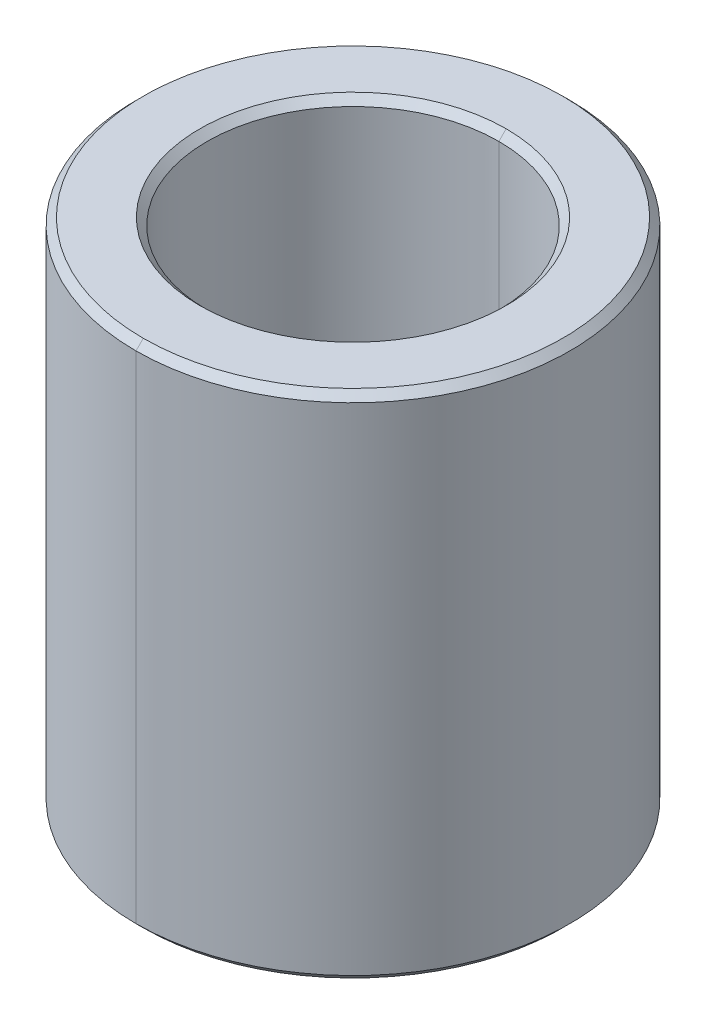
ISO-10303-21;
HEADER;
FILE_DESCRIPTION(('STEP AP214'),'2;1');
FILE_NAME('part.step','',(''),(''),'','','');
FILE_SCHEMA(('AUTOMOTIVE_DESIGN { 1 0 10303 214 1 1 1 1 }'));
ENDSEC;
DATA;
#1=APPLICATION_CONTEXT('core data for automotive mechanical design processes');
#2=APPLICATION_PROTOCOL_DEFINITION('international standard','automotive_design',2000,#1);
#3=PRODUCT_CONTEXT('',#1,'mechanical');
#4=PRODUCT('Part','Part','',(#3));
#5=PRODUCT_RELATED_PRODUCT_CATEGORY('part','',(#4));
#6=PRODUCT_DEFINITION_FORMATION('','',#4);
#7=PRODUCT_DEFINITION_CONTEXT('part definition',#1,'design');
#8=PRODUCT_DEFINITION('design','',#6,#7);
#9=PRODUCT_DEFINITION_SHAPE('','',#8);
#10=(LENGTH_UNIT() NAMED_UNIT(*) SI_UNIT(.MILLI.,.METRE.));
#11=(NAMED_UNIT(*) PLANE_ANGLE_UNIT() SI_UNIT($,.RADIAN.));
#12=(NAMED_UNIT(*) SI_UNIT($,.STERADIAN.) SOLID_ANGLE_UNIT());
#13=UNCERTAINTY_MEASURE_WITH_UNIT(LENGTH_MEASURE(1.E-05),#10,'distance_accuracy_value','');
#14=(GEOMETRIC_REPRESENTATION_CONTEXT(3) GLOBAL_UNCERTAINTY_ASSIGNED_CONTEXT((#13)) GLOBAL_UNIT_ASSIGNED_CONTEXT((#10,
#11,#12)) REPRESENTATION_CONTEXT('',''));
#15=CARTESIAN_POINT('',(0.,0.,0.));
#16=DIRECTION('',(0.,0.,1.));
#17=DIRECTION('',(1.,0.,0.));
#18=AXIS2_PLACEMENT_3D('',#15,#16,#17);
#19=CARTESIAN_POINT('',(0.,3.4,0.));
#20=DIRECTION('',(0.,1.,0.));
#21=DIRECTION('',(0.,0.,1.));
#22=AXIS2_PLACEMENT_3D('',#19,#20,#21);
#23=CONICAL_SURFACE('',#22,2.,0.78539816339745);
#24=DIRECTION('',(0.,0.707106781186546,-0.707106781186549));
#25=VECTOR('',#24,1.);
#26=CARTESIAN_POINT('',(0.,3.4,-2.));
#27=LINE('',#26,#25);
#28=CARTESIAN_POINT('',(0.,3.4,-2.));
#29=VERTEX_POINT('',#28);
#30=CARTESIAN_POINT('',(0.,3.5,-2.1));
#31=VERTEX_POINT('',#30);
#32=EDGE_CURVE('E129',#29,#31,#27,.T.);
#33=ORIENTED_EDGE('',*,*,#32,.F.);
#34=CARTESIAN_POINT('',(0.,3.4,0.));
#35=DIRECTION('',(0.,1.,0.));
#36=DIRECTION('',(0.,0.,1.));
#37=AXIS2_PLACEMENT_3D('',#34,#35,#36);
#38=CIRCLE('',#37,2.);
#39=CARTESIAN_POINT('',(0.,3.4,2.));
#40=VERTEX_POINT('',#39);
#41=EDGE_CURVE('E18',#40,#29,#38,.T.);
#42=ORIENTED_EDGE('',*,*,#41,.F.);
#43=DIRECTION('',(0.,0.707106781186546,0.707106781186549));
#44=VECTOR('',#43,1.);
#45=CARTESIAN_POINT('',(0.,3.4,2.));
#46=LINE('',#45,#44);
#47=CARTESIAN_POINT('',(0.,3.5,2.1));
#48=VERTEX_POINT('',#47);
#49=EDGE_CURVE('E128',#40,#48,#46,.T.);
#50=ORIENTED_EDGE('',*,*,#49,.T.);
#51=CARTESIAN_POINT('',(0.,3.5,0.));
#52=DIRECTION('',(0.,-1.,0.));
#53=DIRECTION('',(0.,0.,1.));
#54=AXIS2_PLACEMENT_3D('',#51,#52,#53);
#55=CIRCLE('',#54,2.1);
#56=EDGE_CURVE('E98',#31,#48,#55,.T.);
#57=ORIENTED_EDGE('',*,*,#56,.F.);
#58=EDGE_LOOP('',(#33,#42,#50,#57));
#59=FACE_BOUND('',#58,.T.);
#60=ADVANCED_FACE('F14',(#59),#23,.F.);
#61=CARTESIAN_POINT('',(0.,-3.5,0.));
#62=DIRECTION('',(0.,-1.,0.));
#63=DIRECTION('',(0.,0.,-1.));
#64=AXIS2_PLACEMENT_3D('',#61,#62,#63);
#65=CONICAL_SURFACE('',#64,2.1,0.785398163397443);
#66=DIRECTION('',(0.,-0.707106781186551,0.707106781186545));
#67=VECTOR('',#66,1.);
#68=CARTESIAN_POINT('',(0.,-3.5,2.1));
#69=LINE('',#68,#67);
#70=CARTESIAN_POINT('',(0.,-3.4,2.));
#71=VERTEX_POINT('',#70);
#72=CARTESIAN_POINT('',(0.,-3.5,2.1));
#73=VERTEX_POINT('',#72);
#74=EDGE_CURVE('E151',#71,#73,#69,.T.);
#75=ORIENTED_EDGE('',*,*,#74,.F.);
#76=CARTESIAN_POINT('',(0.,-3.4,0.));
#77=DIRECTION('',(0.,-1.,0.));
#78=DIRECTION('',(0.,0.,1.));
#79=AXIS2_PLACEMENT_3D('',#76,#77,#78);
#80=CIRCLE('',#79,2.);
#81=CARTESIAN_POINT('',(0.,-3.4,-2.));
#82=VERTEX_POINT('',#81);
#83=EDGE_CURVE('E9',#82,#71,#80,.T.);
#84=ORIENTED_EDGE('',*,*,#83,.F.);
#85=DIRECTION('',(0.,-0.707106781186551,-0.707106781186545));
#86=VECTOR('',#85,1.);
#87=CARTESIAN_POINT('',(0.,-3.5,-2.1));
#88=LINE('',#87,#86);
#89=CARTESIAN_POINT('',(0.,-3.5,-2.1));
#90=VERTEX_POINT('',#89);
#91=EDGE_CURVE('E111',#82,#90,#88,.T.);
#92=ORIENTED_EDGE('',*,*,#91,.T.);
#93=CARTESIAN_POINT('',(0.,-3.5,0.));
#94=DIRECTION('',(0.,1.,0.));
#95=DIRECTION('',(0.,0.,1.));
#96=AXIS2_PLACEMENT_3D('',#93,#94,#95);
#97=CIRCLE('',#96,2.1);
#98=EDGE_CURVE('E174',#73,#90,#97,.T.);
#99=ORIENTED_EDGE('',*,*,#98,.F.);
#100=EDGE_LOOP('',(#75,#84,#92,#99));
#101=FACE_BOUND('',#100,.T.);
#102=ADVANCED_FACE('F209',(#101),#65,.F.);
#103=CARTESIAN_POINT('',(0.,3.5,0.));
#104=DIRECTION('',(0.,-1.,0.));
#105=DIRECTION('',(0.,0.,-1.));
#106=AXIS2_PLACEMENT_3D('',#103,#104,#105);
#107=CONICAL_SURFACE('',#106,2.875,0.785398163397448);
#108=DIRECTION('',(0.,-0.707106781186548,0.707106781186548));
#109=VECTOR('',#108,1.);
#110=CARTESIAN_POINT('',(0.,3.5,2.875));
#111=LINE('',#110,#109);
#112=CARTESIAN_POINT('',(0.,3.5,2.875));
#113=VERTEX_POINT('',#112);
#114=CARTESIAN_POINT('',(0.,3.4,2.975));
#115=VERTEX_POINT('',#114);
#116=EDGE_CURVE('E93',#113,#115,#111,.T.);
#117=ORIENTED_EDGE('',*,*,#116,.F.);
#118=CARTESIAN_POINT('',(0.,3.5,0.));
#119=DIRECTION('',(0.,1.,0.));
#120=DIRECTION('',(0.,0.,1.));
#121=AXIS2_PLACEMENT_3D('',#118,#119,#120);
#122=CIRCLE('',#121,2.875);
#123=CARTESIAN_POINT('',(0.,3.5,-2.875));
#124=VERTEX_POINT('',#123);
#125=EDGE_CURVE('E87',#124,#113,#122,.T.);
#126=ORIENTED_EDGE('',*,*,#125,.F.);
#127=DIRECTION('',(0.,-0.707106781186548,-0.707106781186548));
#128=VECTOR('',#127,1.);
#129=CARTESIAN_POINT('',(0.,3.5,-2.875));
#130=LINE('',#129,#128);
#131=CARTESIAN_POINT('',(0.,3.4,-2.975));
#132=VERTEX_POINT('',#131);
#133=EDGE_CURVE('E90',#124,#132,#130,.T.);
#134=ORIENTED_EDGE('',*,*,#133,.T.);
#135=CARTESIAN_POINT('',(0.,3.4,0.));
#136=DIRECTION('',(0.,-1.,0.));
#137=DIRECTION('',(0.,0.,1.));
#138=AXIS2_PLACEMENT_3D('',#135,#136,#137);
#139=CIRCLE('',#138,2.975);
#140=EDGE_CURVE('E168',#115,#132,#139,.T.);
#141=ORIENTED_EDGE('',*,*,#140,.F.);
#142=EDGE_LOOP('',(#117,#126,#134,#141));
#143=FACE_BOUND('',#142,.T.);
#144=ADVANCED_FACE('F89',(#143),#107,.T.);
#145=CARTESIAN_POINT('',(0.,-3.4,0.));
#146=DIRECTION('',(0.,1.,0.));
#147=DIRECTION('',(0.,0.,1.));
#148=AXIS2_PLACEMENT_3D('',#145,#146,#147);
#149=CONICAL_SURFACE('',#148,2.975,0.785398163397455);
#150=DIRECTION('',(0.,0.707106781186543,-0.707106781186552));
#151=VECTOR('',#150,1.);
#152=CARTESIAN_POINT('',(0.,-3.4,-2.975));
#153=LINE('',#152,#151);
#154=CARTESIAN_POINT('',(0.,-3.5,-2.875));
#155=VERTEX_POINT('',#154);
#156=CARTESIAN_POINT('',(0.,-3.4,-2.975));
#157=VERTEX_POINT('',#156);
#158=EDGE_CURVE('E140',#155,#157,#153,.T.);
#159=ORIENTED_EDGE('',*,*,#158,.F.);
#160=CARTESIAN_POINT('',(0.,-3.5,0.));
#161=DIRECTION('',(0.,-1.,0.));
#162=DIRECTION('',(0.,0.,1.));
#163=AXIS2_PLACEMENT_3D('',#160,#161,#162);
#164=CIRCLE('',#163,2.875);
#165=CARTESIAN_POINT('',(0.,-3.5,2.875));
#166=VERTEX_POINT('',#165);
#167=EDGE_CURVE('E175',#166,#155,#164,.T.);
#168=ORIENTED_EDGE('',*,*,#167,.F.);
#169=DIRECTION('',(0.,0.707106781186543,0.707106781186552));
#170=VECTOR('',#169,1.);
#171=CARTESIAN_POINT('',(0.,-3.4,2.975));
#172=LINE('',#171,#170);
#173=CARTESIAN_POINT('',(0.,-3.4,2.975));
#174=VERTEX_POINT('',#173);
#175=EDGE_CURVE('E139',#166,#174,#172,.T.);
#176=ORIENTED_EDGE('',*,*,#175,.T.);
#177=CARTESIAN_POINT('',(0.,-3.4,0.));
#178=DIRECTION('',(0.,1.,0.));
#179=DIRECTION('',(0.,0.,1.));
#180=AXIS2_PLACEMENT_3D('',#177,#178,#179);
#181=CIRCLE('',#180,2.975);
#182=EDGE_CURVE('E39',#157,#174,#181,.T.);
#183=ORIENTED_EDGE('',*,*,#182,.F.);
#184=EDGE_LOOP('',(#159,#168,#176,#183));
#185=FACE_BOUND('',#184,.T.);
#186=ADVANCED_FACE('F280',(#185),#149,.T.);
#187=CARTESIAN_POINT('',(0.,3.5,0.));
#188=DIRECTION('',(0.,-1.,0.));
#189=DIRECTION('',(0.,0.,-1.));
#190=AXIS2_PLACEMENT_3D('',#187,#188,#189);
#191=CYLINDRICAL_SURFACE('',#190,2.);
#192=DIRECTION('',(0.,-1.,0.));
#193=VECTOR('',#192,1.);
#194=CARTESIAN_POINT('',(0.,3.5,2.));
#195=LINE('',#194,#193);
#196=EDGE_CURVE('E143',#40,#71,#195,.T.);
#197=ORIENTED_EDGE('',*,*,#196,.F.);
#198=ORIENTED_EDGE('',*,*,#41,.T.);
#199=DIRECTION('',(0.,-1.,0.));
#200=VECTOR('',#199,1.);
#201=CARTESIAN_POINT('',(0.,3.5,-2.));
#202=LINE('',#201,#200);
#203=EDGE_CURVE('E147',#29,#82,#202,.T.);
#204=ORIENTED_EDGE('',*,*,#203,.T.);
#205=ORIENTED_EDGE('',*,*,#83,.T.);
#206=EDGE_LOOP('',(#197,#198,#204,#205));
#207=FACE_BOUND('',#206,.T.);
#208=ADVANCED_FACE('F236',(#207),#191,.F.);
#209=CARTESIAN_POINT('',(0.,3.5,0.));
#210=DIRECTION('',(0.,-1.,0.));
#211=DIRECTION('',(0.,0.,-1.));
#212=AXIS2_PLACEMENT_3D('',#209,#210,#211);
#213=CYLINDRICAL_SURFACE('',#212,2.975);
#214=DIRECTION('',(0.,-1.,0.));
#215=VECTOR('',#214,1.);
#216=CARTESIAN_POINT('',(0.,3.5,2.975));
#217=LINE('',#216,#215);
#218=EDGE_CURVE('E159',#115,#174,#217,.T.);
#219=ORIENTED_EDGE('',*,*,#218,.F.);
#220=ORIENTED_EDGE('',*,*,#140,.T.);
#221=DIRECTION('',(0.,-1.,0.));
#222=VECTOR('',#221,1.);
#223=CARTESIAN_POINT('',(0.,3.5,-2.975));
#224=LINE('',#223,#222);
#225=EDGE_CURVE('E99',#132,#157,#224,.T.);
#226=ORIENTED_EDGE('',*,*,#225,.T.);
#227=ORIENTED_EDGE('',*,*,#182,.T.);
#228=EDGE_LOOP('',(#219,#220,#226,#227));
#229=FACE_BOUND('',#228,.T.);
#230=ADVANCED_FACE('F319',(#229),#213,.T.);
#231=CARTESIAN_POINT('',(0.,-3.5,0.));
#232=DIRECTION('',(0.,1.,0.));
#233=DIRECTION('',(1.,0.,0.));
#234=AXIS2_PLACEMENT_3D('',#231,#232,#233);
#235=PLANE('',#234);
#236=CARTESIAN_POINT('',(0.,-3.5,0.));
#237=DIRECTION('',(0.,1.,0.));
#238=DIRECTION('',(0.,0.,1.));
#239=AXIS2_PLACEMENT_3D('',#236,#237,#238);
#240=CIRCLE('',#239,2.1);
#241=EDGE_CURVE('E120',#90,#73,#240,.T.);
#242=ORIENTED_EDGE('',*,*,#241,.T.);
#243=ORIENTED_EDGE('',*,*,#98,.T.);
#244=EDGE_LOOP('',(#242,#243));
#245=FACE_BOUND('',#244,.T.);
#246=ORIENTED_EDGE('',*,*,#167,.T.);
#247=CARTESIAN_POINT('',(0.,-3.5,0.));
#248=DIRECTION('',(0.,-1.,0.));
#249=DIRECTION('',(0.,0.,1.));
#250=AXIS2_PLACEMENT_3D('',#247,#248,#249);
#251=CIRCLE('',#250,2.875);
#252=EDGE_CURVE('E107',#155,#166,#251,.T.);
#253=ORIENTED_EDGE('',*,*,#252,.T.);
#254=EDGE_LOOP('',(#246,#253));
#255=FACE_BOUND('',#254,.T.);
#256=ADVANCED_FACE('F202',(#245,#255),#235,.F.);
#257=CARTESIAN_POINT('',(0.,3.5,0.));
#258=DIRECTION('',(0.,1.,0.));
#259=DIRECTION('',(1.,0.,0.));
#260=AXIS2_PLACEMENT_3D('',#257,#258,#259);
#261=PLANE('',#260);
#262=CARTESIAN_POINT('',(0.,3.5,0.));
#263=DIRECTION('',(0.,-1.,0.));
#264=DIRECTION('',(0.,0.,1.));
#265=AXIS2_PLACEMENT_3D('',#262,#263,#264);
#266=CIRCLE('',#265,2.1);
#267=EDGE_CURVE('E125',#48,#31,#266,.T.);
#268=ORIENTED_EDGE('',*,*,#267,.T.);
#269=ORIENTED_EDGE('',*,*,#56,.T.);
#270=EDGE_LOOP('',(#268,#269));
#271=FACE_BOUND('',#270,.T.);
#272=ORIENTED_EDGE('',*,*,#125,.T.);
#273=CARTESIAN_POINT('',(0.,3.5,0.));
#274=DIRECTION('',(0.,1.,0.));
#275=DIRECTION('',(0.,0.,1.));
#276=AXIS2_PLACEMENT_3D('',#273,#274,#275);
#277=CIRCLE('',#276,2.875);
#278=EDGE_CURVE('E103',#113,#124,#277,.T.);
#279=ORIENTED_EDGE('',*,*,#278,.T.);
#280=EDGE_LOOP('',(#272,#279));
#281=FACE_BOUND('',#280,.T.);
#282=ADVANCED_FACE('F109',(#271,#281),#261,.T.);
#283=CARTESIAN_POINT('',(0.,3.5,0.));
#284=DIRECTION('',(0.,-1.,0.));
#285=DIRECTION('',(0.,0.,-1.));
#286=AXIS2_PLACEMENT_3D('',#283,#284,#285);
#287=CYLINDRICAL_SURFACE('',#286,2.975);
#288=CARTESIAN_POINT('',(0.,3.4,0.));
#289=DIRECTION('',(0.,-1.,0.));
#290=DIRECTION('',(0.,0.,1.));
#291=AXIS2_PLACEMENT_3D('',#288,#289,#290);
#292=CIRCLE('',#291,2.975);
#293=EDGE_CURVE('E105',#132,#115,#292,.T.);
#294=ORIENTED_EDGE('',*,*,#293,.T.);
#295=ORIENTED_EDGE('',*,*,#218,.T.);
#296=CARTESIAN_POINT('',(0.,-3.4,0.));
#297=DIRECTION('',(0.,1.,0.));
#298=DIRECTION('',(0.,0.,1.));
#299=AXIS2_PLACEMENT_3D('',#296,#297,#298);
#300=CIRCLE('',#299,2.975);
#301=EDGE_CURVE('E135',#174,#157,#300,.T.);
#302=ORIENTED_EDGE('',*,*,#301,.T.);
#303=ORIENTED_EDGE('',*,*,#225,.F.);
#304=EDGE_LOOP('',(#294,#295,#302,#303));
#305=FACE_BOUND('',#304,.T.);
#306=ADVANCED_FACE('F257',(#305),#287,.T.);
#307=CARTESIAN_POINT('',(0.,3.5,0.));
#308=DIRECTION('',(0.,-1.,0.));
#309=DIRECTION('',(0.,0.,-1.));
#310=AXIS2_PLACEMENT_3D('',#307,#308,#309);
#311=CYLINDRICAL_SURFACE('',#310,2.);
#312=CARTESIAN_POINT('',(0.,3.4,0.));
#313=DIRECTION('',(0.,1.,0.));
#314=DIRECTION('',(0.,0.,1.));
#315=AXIS2_PLACEMENT_3D('',#312,#313,#314);
#316=CIRCLE('',#315,2.);
#317=EDGE_CURVE('E131',#29,#40,#316,.T.);
#318=ORIENTED_EDGE('',*,*,#317,.T.);
#319=ORIENTED_EDGE('',*,*,#196,.T.);
#320=CARTESIAN_POINT('',(0.,-3.4,0.));
#321=DIRECTION('',(0.,-1.,0.));
#322=DIRECTION('',(0.,0.,1.));
#323=AXIS2_PLACEMENT_3D('',#320,#321,#322);
#324=CIRCLE('',#323,2.);
#325=EDGE_CURVE('E155',#71,#82,#324,.T.);
#326=ORIENTED_EDGE('',*,*,#325,.T.);
#327=ORIENTED_EDGE('',*,*,#203,.F.);
#328=EDGE_LOOP('',(#318,#319,#326,#327));
#329=FACE_BOUND('',#328,.T.);
#330=ADVANCED_FACE('F233',(#329),#311,.F.);
#331=CARTESIAN_POINT('',(0.,-3.4,0.));
#332=DIRECTION('',(0.,1.,0.));
#333=DIRECTION('',(0.,0.,1.));
#334=AXIS2_PLACEMENT_3D('',#331,#332,#333);
#335=CONICAL_SURFACE('',#334,2.975,0.785398163397455);
#336=ORIENTED_EDGE('',*,*,#252,.F.);
#337=ORIENTED_EDGE('',*,*,#158,.T.);
#338=ORIENTED_EDGE('',*,*,#301,.F.);
#339=ORIENTED_EDGE('',*,*,#175,.F.);
#340=EDGE_LOOP('',(#336,#337,#338,#339));
#341=FACE_BOUND('',#340,.T.);
#342=ADVANCED_FACE('F298',(#341),#335,.T.);
#343=CARTESIAN_POINT('',(0.,3.5,0.));
#344=DIRECTION('',(0.,-1.,0.));
#345=DIRECTION('',(0.,0.,-1.));
#346=AXIS2_PLACEMENT_3D('',#343,#344,#345);
#347=CONICAL_SURFACE('',#346,2.875,0.785398163397448);
#348=ORIENTED_EDGE('',*,*,#278,.F.);
#349=ORIENTED_EDGE('',*,*,#116,.T.);
#350=ORIENTED_EDGE('',*,*,#293,.F.);
#351=ORIENTED_EDGE('',*,*,#133,.F.);
#352=EDGE_LOOP('',(#348,#349,#350,#351));
#353=FACE_BOUND('',#352,.T.);
#354=ADVANCED_FACE('F102',(#353),#347,.T.);
#355=CARTESIAN_POINT('',(0.,-3.5,0.));
#356=DIRECTION('',(0.,-1.,0.));
#357=DIRECTION('',(0.,0.,-1.));
#358=AXIS2_PLACEMENT_3D('',#355,#356,#357);
#359=CONICAL_SURFACE('',#358,2.1,0.785398163397443);
#360=ORIENTED_EDGE('',*,*,#325,.F.);
#361=ORIENTED_EDGE('',*,*,#74,.T.);
#362=ORIENTED_EDGE('',*,*,#241,.F.);
#363=ORIENTED_EDGE('',*,*,#91,.F.);
#364=EDGE_LOOP('',(#360,#361,#362,#363));
#365=FACE_BOUND('',#364,.T.);
#366=ADVANCED_FACE('F212',(#365),#359,.F.);
#367=CARTESIAN_POINT('',(0.,3.4,0.));
#368=DIRECTION('',(0.,1.,0.));
#369=DIRECTION('',(0.,0.,1.));
#370=AXIS2_PLACEMENT_3D('',#367,#368,#369);
#371=CONICAL_SURFACE('',#370,2.,0.78539816339745);
#372=ORIENTED_EDGE('',*,*,#317,.F.);
#373=ORIENTED_EDGE('',*,*,#32,.T.);
#374=ORIENTED_EDGE('',*,*,#267,.F.);
#375=ORIENTED_EDGE('',*,*,#49,.F.);
#376=EDGE_LOOP('',(#372,#373,#374,#375));
#377=FACE_BOUND('',#376,.T.);
#378=ADVANCED_FACE('F16',(#377),#371,.F.);
#379=CLOSED_SHELL('',(#60,#102,#144,#186,#208,#230,#256,#282,#306,#330,#342,#354,#366,#378));
#380=MANIFOLD_SOLID_BREP('B1',#379);
#381=ADVANCED_BREP_SHAPE_REPRESENTATION('',(#18,#380),#14);
#382=SHAPE_DEFINITION_REPRESENTATION(#9,#381);
ENDSEC;
END-ISO-10303-21;
